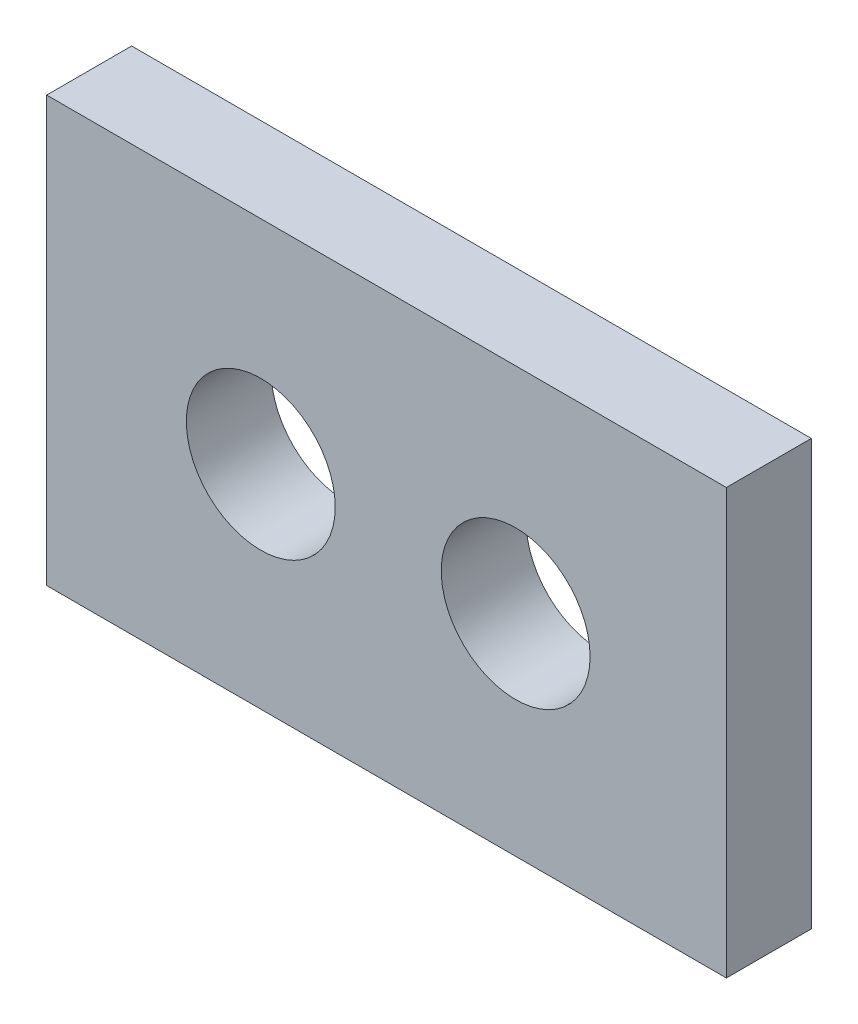
ISO-10303-21;
HEADER;
FILE_DESCRIPTION(('STEP AP214'),'2;1');
FILE_NAME('part.step','',(''),(''),'','','');
FILE_SCHEMA(('AUTOMOTIVE_DESIGN { 1 0 10303 214 1 1 1 1 }'));
ENDSEC;
DATA;
#1=APPLICATION_CONTEXT('core data for automotive mechanical design processes');
#2=APPLICATION_PROTOCOL_DEFINITION('international standard','automotive_design',2000,#1);
#3=PRODUCT_CONTEXT('',#1,'mechanical');
#4=PRODUCT('Part','Part','',(#3));
#5=PRODUCT_RELATED_PRODUCT_CATEGORY('part','',(#4));
#6=PRODUCT_DEFINITION_FORMATION('','',#4);
#7=PRODUCT_DEFINITION_CONTEXT('part definition',#1,'design');
#8=PRODUCT_DEFINITION('design','',#6,#7);
#9=PRODUCT_DEFINITION_SHAPE('','',#8);
#10=(LENGTH_UNIT() NAMED_UNIT(*) SI_UNIT(.MILLI.,.METRE.));
#11=(NAMED_UNIT(*) PLANE_ANGLE_UNIT() SI_UNIT($,.RADIAN.));
#12=(NAMED_UNIT(*) SI_UNIT($,.STERADIAN.) SOLID_ANGLE_UNIT());
#13=UNCERTAINTY_MEASURE_WITH_UNIT(LENGTH_MEASURE(1.E-05),#10,'distance_accuracy_value','');
#14=(GEOMETRIC_REPRESENTATION_CONTEXT(3) GLOBAL_UNCERTAINTY_ASSIGNED_CONTEXT((#13)) GLOBAL_UNIT_ASSIGNED_CONTEXT((#10,
#11,#12)) REPRESENTATION_CONTEXT('',''));
#15=CARTESIAN_POINT('',(0.,0.,0.));
#16=DIRECTION('',(0.,0.,1.));
#17=DIRECTION('',(1.,0.,0.));
#18=AXIS2_PLACEMENT_3D('',#15,#16,#17);
#19=CARTESIAN_POINT('',(0.,0.,2.));
#20=DIRECTION('',(0.,0.,-1.));
#21=DIRECTION('',(-1.,0.,0.));
#22=AXIS2_PLACEMENT_3D('',#19,#20,#21);
#23=PLANE('',#22);
#24=DIRECTION('',(0.,-1.,0.));
#25=VECTOR('',#24,1.);
#26=CARTESIAN_POINT('',(0.,0.,2.));
#27=LINE('',#26,#25);
#28=CARTESIAN_POINT('',(0.,10.,2.));
#29=VERTEX_POINT('',#28);
#30=CARTESIAN_POINT('',(0.,0.,2.));
#31=VERTEX_POINT('',#30);
#32=EDGE_CURVE('E92',#29,#31,#27,.T.);
#33=ORIENTED_EDGE('',*,*,#32,.T.);
#34=DIRECTION('',(1.,0.,0.));
#35=VECTOR('',#34,1.);
#36=CARTESIAN_POINT('',(0.,0.,2.));
#37=LINE('',#36,#35);
#38=CARTESIAN_POINT('',(16.,0.,2.));
#39=VERTEX_POINT('',#38);
#40=EDGE_CURVE('E87',#31,#39,#37,.T.);
#41=ORIENTED_EDGE('',*,*,#40,.T.);
#42=DIRECTION('',(0.,1.,0.));
#43=VECTOR('',#42,1.);
#44=CARTESIAN_POINT('',(16.,0.,2.));
#45=LINE('',#44,#43);
#46=CARTESIAN_POINT('',(16.,10.,2.));
#47=VERTEX_POINT('',#46);
#48=EDGE_CURVE('E90',#39,#47,#45,.T.);
#49=ORIENTED_EDGE('',*,*,#48,.T.);
#50=DIRECTION('',(-1.,0.,0.));
#51=VECTOR('',#50,1.);
#52=CARTESIAN_POINT('',(0.,10.,2.));
#53=LINE('',#52,#51);
#54=EDGE_CURVE('E57',#47,#29,#53,.T.);
#55=ORIENTED_EDGE('',*,*,#54,.T.);
#56=EDGE_LOOP('',(#33,#41,#49,#55));
#57=FACE_BOUND('',#56,.T.);
#58=CARTESIAN_POINT('',(5.04008123688131,4.99280260806435,2.));
#59=DIRECTION('',(0.,0.,1.));
#60=DIRECTION('',(1.,0.,0.));
#61=AXIS2_PLACEMENT_3D('',#58,#59,#60);
#62=CIRCLE('',#61,1.752491691273);
#63=CARTESIAN_POINT('',(6.7925729281543,4.99280260806435,2.));
#64=VERTEX_POINT('',#63);
#65=EDGE_CURVE('E112',#64,#64,#62,.T.);
#66=ORIENTED_EDGE('',*,*,#65,.F.);
#67=EDGE_LOOP('',(#66));
#68=FACE_BOUND('',#67,.T.);
#69=CARTESIAN_POINT('',(11.0399088861878,4.94732537621365,2.));
#70=DIRECTION('',(0.,0.,1.));
#71=DIRECTION('',(1.,0.,0.));
#72=AXIS2_PLACEMENT_3D('',#69,#70,#71);
#73=CIRCLE('',#72,1.752491691273);
#74=CARTESIAN_POINT('',(12.7924005774608,4.94732537621365,2.));
#75=VERTEX_POINT('',#74);
#76=EDGE_CURVE('E134',#75,#75,#73,.T.);
#77=ORIENTED_EDGE('',*,*,#76,.F.);
#78=EDGE_LOOP('',(#77));
#79=FACE_BOUND('',#78,.T.);
#80=ADVANCED_FACE('F39',(#57,#68,#79),#23,.F.);
#81=CARTESIAN_POINT('',(0.,0.,0.));
#82=DIRECTION('',(0.,0.,-1.));
#83=DIRECTION('',(-1.,0.,0.));
#84=AXIS2_PLACEMENT_3D('',#81,#82,#83);
#85=PLANE('',#84);
#86=CARTESIAN_POINT('',(5.04008123688131,4.99280260806435,0.));
#87=DIRECTION('',(0.,0.,1.));
#88=DIRECTION('',(1.,0.,0.));
#89=AXIS2_PLACEMENT_3D('',#86,#87,#88);
#90=CIRCLE('',#89,1.752491691273);
#91=CARTESIAN_POINT('',(6.7925729281543,4.99280260806435,0.));
#92=VERTEX_POINT('',#91);
#93=EDGE_CURVE('E130',#92,#92,#90,.T.);
#94=ORIENTED_EDGE('',*,*,#93,.T.);
#95=EDGE_LOOP('',(#94));
#96=FACE_BOUND('',#95,.T.);
#97=DIRECTION('',(0.,-1.,0.));
#98=VECTOR('',#97,1.);
#99=CARTESIAN_POINT('',(0.,0.,0.));
#100=LINE('',#99,#98);
#101=CARTESIAN_POINT('',(0.,10.,0.));
#102=VERTEX_POINT('',#101);
#103=CARTESIAN_POINT('',(0.,0.,0.));
#104=VERTEX_POINT('',#103);
#105=EDGE_CURVE('E108',#102,#104,#100,.T.);
#106=ORIENTED_EDGE('',*,*,#105,.F.);
#107=DIRECTION('',(-1.,0.,0.));
#108=VECTOR('',#107,1.);
#109=CARTESIAN_POINT('',(0.,10.,0.));
#110=LINE('',#109,#108);
#111=CARTESIAN_POINT('',(16.,10.,0.));
#112=VERTEX_POINT('',#111);
#113=EDGE_CURVE('E80',#112,#102,#110,.T.);
#114=ORIENTED_EDGE('',*,*,#113,.F.);
#115=DIRECTION('',(0.,1.,0.));
#116=VECTOR('',#115,1.);
#117=CARTESIAN_POINT('',(16.,0.,0.));
#118=LINE('',#117,#116);
#119=CARTESIAN_POINT('',(16.,0.,0.));
#120=VERTEX_POINT('',#119);
#121=EDGE_CURVE('E74',#120,#112,#118,.T.);
#122=ORIENTED_EDGE('',*,*,#121,.F.);
#123=DIRECTION('',(1.,0.,0.));
#124=VECTOR('',#123,1.);
#125=CARTESIAN_POINT('',(0.,0.,0.));
#126=LINE('',#125,#124);
#127=EDGE_CURVE('E97',#104,#120,#126,.T.);
#128=ORIENTED_EDGE('',*,*,#127,.F.);
#129=EDGE_LOOP('',(#106,#114,#122,#128));
#130=FACE_BOUND('',#129,.T.);
#131=CARTESIAN_POINT('',(11.0399088861878,4.94732537621365,0.));
#132=DIRECTION('',(0.,0.,1.));
#133=DIRECTION('',(1.,0.,0.));
#134=AXIS2_PLACEMENT_3D('',#131,#132,#133);
#135=CIRCLE('',#134,1.752491691273);
#136=CARTESIAN_POINT('',(12.7924005774608,4.94732537621365,0.));
#137=VERTEX_POINT('',#136);
#138=EDGE_CURVE('E138',#137,#137,#135,.T.);
#139=ORIENTED_EDGE('',*,*,#138,.T.);
#140=EDGE_LOOP('',(#139));
#141=FACE_BOUND('',#140,.T.);
#142=ADVANCED_FACE('F125',(#96,#130,#141),#85,.T.);
#143=CARTESIAN_POINT('',(0.,0.,2.));
#144=DIRECTION('',(1.,0.,0.));
#145=DIRECTION('',(0.,0.,-1.));
#146=AXIS2_PLACEMENT_3D('',#143,#144,#145);
#147=PLANE('',#146);
#148=ORIENTED_EDGE('',*,*,#105,.T.);
#149=DIRECTION('',(0.,0.,-1.));
#150=VECTOR('',#149,1.);
#151=CARTESIAN_POINT('',(0.,0.,2.));
#152=LINE('',#151,#150);
#153=EDGE_CURVE('E11',#31,#104,#152,.T.);
#154=ORIENTED_EDGE('',*,*,#153,.F.);
#155=ORIENTED_EDGE('',*,*,#32,.F.);
#156=DIRECTION('',(0.,0.,-1.));
#157=VECTOR('',#156,1.);
#158=CARTESIAN_POINT('',(0.,10.,2.));
#159=LINE('',#158,#157);
#160=EDGE_CURVE('E104',#29,#102,#159,.T.);
#161=ORIENTED_EDGE('',*,*,#160,.T.);
#162=EDGE_LOOP('',(#148,#154,#155,#161));
#163=FACE_BOUND('',#162,.T.);
#164=ADVANCED_FACE('F41',(#163),#147,.F.);
#165=CARTESIAN_POINT('',(0.,0.,2.));
#166=DIRECTION('',(0.,1.,0.));
#167=DIRECTION('',(0.,0.,1.));
#168=AXIS2_PLACEMENT_3D('',#165,#166,#167);
#169=PLANE('',#168);
#170=ORIENTED_EDGE('',*,*,#127,.T.);
#171=DIRECTION('',(0.,0.,-1.));
#172=VECTOR('',#171,1.);
#173=CARTESIAN_POINT('',(16.,0.,2.));
#174=LINE('',#173,#172);
#175=EDGE_CURVE('E49',#39,#120,#174,.T.);
#176=ORIENTED_EDGE('',*,*,#175,.F.);
#177=ORIENTED_EDGE('',*,*,#40,.F.);
#178=ORIENTED_EDGE('',*,*,#153,.T.);
#179=EDGE_LOOP('',(#170,#176,#177,#178));
#180=FACE_BOUND('',#179,.T.);
#181=ADVANCED_FACE('F96',(#180),#169,.F.);
#182=CARTESIAN_POINT('',(16.,0.,2.));
#183=DIRECTION('',(-1.,0.,0.));
#184=DIRECTION('',(0.,0.,1.));
#185=AXIS2_PLACEMENT_3D('',#182,#183,#184);
#186=PLANE('',#185);
#187=ORIENTED_EDGE('',*,*,#121,.T.);
#188=DIRECTION('',(0.,0.,-1.));
#189=VECTOR('',#188,1.);
#190=CARTESIAN_POINT('',(16.,10.,2.));
#191=LINE('',#190,#189);
#192=EDGE_CURVE('E99',#47,#112,#191,.T.);
#193=ORIENTED_EDGE('',*,*,#192,.F.);
#194=ORIENTED_EDGE('',*,*,#48,.F.);
#195=ORIENTED_EDGE('',*,*,#175,.T.);
#196=EDGE_LOOP('',(#187,#193,#194,#195));
#197=FACE_BOUND('',#196,.T.);
#198=ADVANCED_FACE('F100',(#197),#186,.F.);
#199=CARTESIAN_POINT('',(0.,10.,2.));
#200=DIRECTION('',(0.,-1.,0.));
#201=DIRECTION('',(0.,0.,-1.));
#202=AXIS2_PLACEMENT_3D('',#199,#200,#201);
#203=PLANE('',#202);
#204=ORIENTED_EDGE('',*,*,#113,.T.);
#205=ORIENTED_EDGE('',*,*,#160,.F.);
#206=ORIENTED_EDGE('',*,*,#54,.F.);
#207=ORIENTED_EDGE('',*,*,#192,.T.);
#208=EDGE_LOOP('',(#204,#205,#206,#207));
#209=FACE_BOUND('',#208,.T.);
#210=ADVANCED_FACE('F122',(#209),#203,.F.);
#211=CARTESIAN_POINT('',(5.04008123688131,4.99280260806435,2.));
#212=DIRECTION('',(0.,0.,-1.));
#213=DIRECTION('',(-1.,0.,0.));
#214=AXIS2_PLACEMENT_3D('',#211,#212,#213);
#215=CYLINDRICAL_SURFACE('',#214,1.752491691273);
#216=ORIENTED_EDGE('',*,*,#65,.T.);
#217=EDGE_LOOP('',(#216));
#218=FACE_BOUND('',#217,.T.);
#219=ORIENTED_EDGE('',*,*,#93,.F.);
#220=EDGE_LOOP('',(#219));
#221=FACE_BOUND('',#220,.T.);
#222=ADVANCED_FACE('F157',(#218,#221),#215,.F.);
#223=CARTESIAN_POINT('',(11.0399088861878,4.94732537621365,2.));
#224=DIRECTION('',(0.,0.,-1.));
#225=DIRECTION('',(-1.,0.,0.));
#226=AXIS2_PLACEMENT_3D('',#223,#224,#225);
#227=CYLINDRICAL_SURFACE('',#226,1.752491691273);
#228=ORIENTED_EDGE('',*,*,#76,.T.);
#229=EDGE_LOOP('',(#228));
#230=FACE_BOUND('',#229,.T.);
#231=ORIENTED_EDGE('',*,*,#138,.F.);
#232=EDGE_LOOP('',(#231));
#233=FACE_BOUND('',#232,.T.);
#234=ADVANCED_FACE('F146',(#230,#233),#227,.F.);
#235=CLOSED_SHELL('',(#80,#142,#164,#181,#198,#210,#222,#234));
#236=MANIFOLD_SOLID_BREP('B2',#235);
#237=ADVANCED_BREP_SHAPE_REPRESENTATION('',(#18,#236),#14);
#238=SHAPE_DEFINITION_REPRESENTATION(#9,#237);
ENDSEC;
END-ISO-10303-21;
